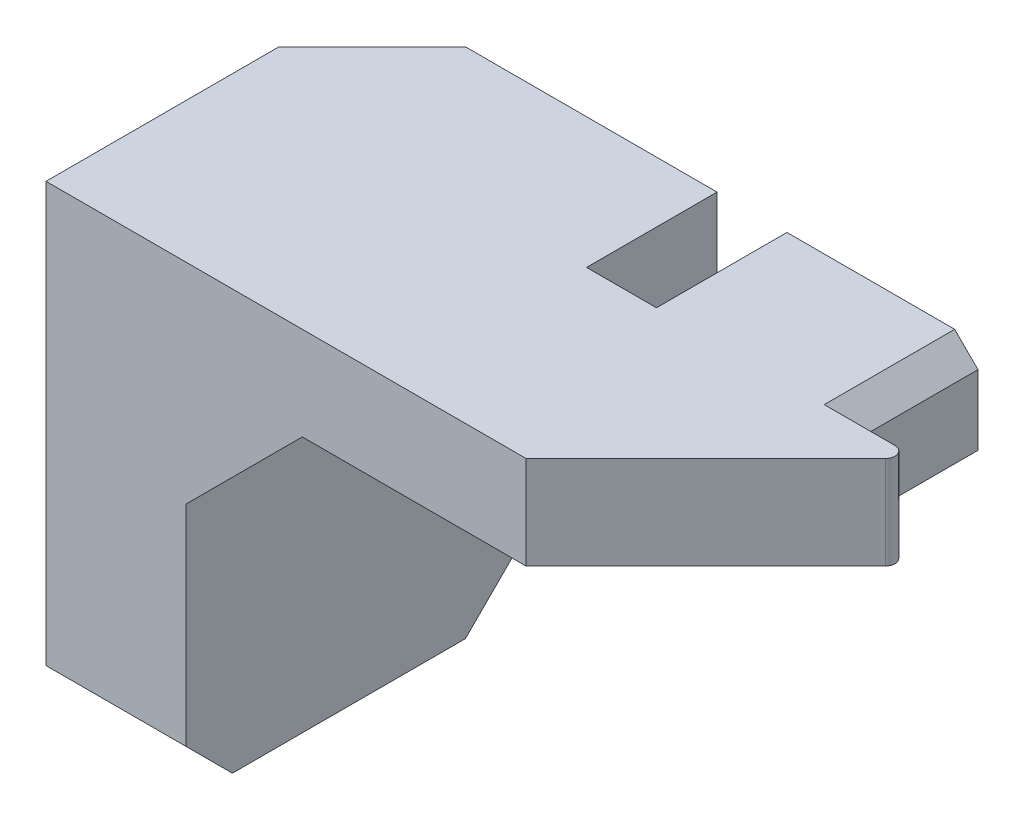
ISO-10303-21;
HEADER;
FILE_DESCRIPTION(('STEP AP214'),'2;1');
FILE_NAME('part.step','',(''),(''),'','','');
FILE_SCHEMA(('AUTOMOTIVE_DESIGN { 1 0 10303 214 1 1 1 1 }'));
ENDSEC;
DATA;
#1=APPLICATION_CONTEXT('core data for automotive mechanical design processes');
#2=APPLICATION_PROTOCOL_DEFINITION('international standard','automotive_design',2000,#1);
#3=PRODUCT_CONTEXT('',#1,'mechanical');
#4=PRODUCT('Part','Part','',(#3));
#5=PRODUCT_RELATED_PRODUCT_CATEGORY('part','',(#4));
#6=PRODUCT_DEFINITION_FORMATION('','',#4);
#7=PRODUCT_DEFINITION_CONTEXT('part definition',#1,'design');
#8=PRODUCT_DEFINITION('design','',#6,#7);
#9=PRODUCT_DEFINITION_SHAPE('','',#8);
#10=(LENGTH_UNIT() NAMED_UNIT(*) SI_UNIT(.MILLI.,.METRE.));
#11=(NAMED_UNIT(*) PLANE_ANGLE_UNIT() SI_UNIT($,.RADIAN.));
#12=(NAMED_UNIT(*) SI_UNIT($,.STERADIAN.) SOLID_ANGLE_UNIT());
#13=UNCERTAINTY_MEASURE_WITH_UNIT(LENGTH_MEASURE(1.E-05),#10,'distance_accuracy_value','');
#14=(GEOMETRIC_REPRESENTATION_CONTEXT(3) GLOBAL_UNCERTAINTY_ASSIGNED_CONTEXT((#13)) GLOBAL_UNIT_ASSIGNED_CONTEXT((#10,
#11,#12)) REPRESENTATION_CONTEXT('',''));
#15=CARTESIAN_POINT('',(0.,0.,0.));
#16=DIRECTION('',(0.,0.,1.));
#17=DIRECTION('',(1.,0.,0.));
#18=AXIS2_PLACEMENT_3D('',#15,#16,#17);
#19=CARTESIAN_POINT('',(0.,0.,0.));
#20=DIRECTION('',(0.,0.,-1.));
#21=DIRECTION('',(-1.,0.,0.));
#22=AXIS2_PLACEMENT_3D('',#19,#20,#21);
#23=PLANE('',#22);
#24=DIRECTION('',(-1.,0.,0.));
#25=VECTOR('',#24,1.);
#26=CARTESIAN_POINT('',(0.,25.4,0.));
#27=LINE('',#26,#25);
#28=CARTESIAN_POINT('',(31.75,25.4,0.));
#29=VERTEX_POINT('',#28);
#30=CARTESIAN_POINT('',(22.606,25.4,0.));
#31=VERTEX_POINT('',#30);
#32=EDGE_CURVE('E203',#29,#31,#27,.T.);
#33=ORIENTED_EDGE('',*,*,#32,.F.);
#34=DIRECTION('',(-0.707106781186544,0.707106781186551,0.));
#35=VECTOR('',#34,1.);
#36=CARTESIAN_POINT('',(28.5750000000002,28.5749999999999,0.));
#37=LINE('',#36,#35);
#38=CARTESIAN_POINT('',(33.02,24.13,0.));
#39=VERTEX_POINT('',#38);
#40=EDGE_CURVE('E261',#29,#39,#37,.F.);
#41=ORIENTED_EDGE('',*,*,#40,.T.);
#42=DIRECTION('',(0.,-1.,0.));
#43=VECTOR('',#42,1.);
#44=CARTESIAN_POINT('',(33.02,25.4,0.));
#45=LINE('',#44,#43);
#46=CARTESIAN_POINT('',(33.02,20.32,0.));
#47=VERTEX_POINT('',#46);
#48=EDGE_CURVE('E321',#39,#47,#45,.T.);
#49=ORIENTED_EDGE('',*,*,#48,.T.);
#50=DIRECTION('',(1.,0.,0.));
#51=VECTOR('',#50,1.);
#52=CARTESIAN_POINT('',(43.18,20.32,0.));
#53=LINE('',#52,#51);
#54=CARTESIAN_POINT('',(21.336,20.32,0.));
#55=VERTEX_POINT('',#54);
#56=EDGE_CURVE('E345',#55,#47,#53,.T.);
#57=ORIENTED_EDGE('',*,*,#56,.F.);
#58=DIRECTION('',(0.,-1.,0.));
#59=VECTOR('',#58,1.);
#60=CARTESIAN_POINT('',(21.336,25.4,0.));
#61=LINE('',#60,#59);
#62=CARTESIAN_POINT('',(21.336,24.13,0.));
#63=VERTEX_POINT('',#62);
#64=EDGE_CURVE('E285',#63,#55,#61,.T.);
#65=ORIENTED_EDGE('',*,*,#64,.F.);
#66=DIRECTION('',(-0.707106781186546,-0.707106781186549,0.));
#67=VECTOR('',#66,1.);
#68=CARTESIAN_POINT('',(-1.39699999999993,1.39699999999992,0.));
#69=LINE('',#68,#67);
#70=EDGE_CURVE('E259',#63,#31,#69,.F.);
#71=ORIENTED_EDGE('',*,*,#70,.T.);
#72=EDGE_LOOP('',(#33,#41,#49,#57,#65,#71));
#73=FACE_BOUND('',#72,.T.);
#74=ADVANCED_FACE('F41',(#73),#23,.T.);
#75=CARTESIAN_POINT('',(7.62,0.,17.78));
#76=DIRECTION('',(0.,1.,0.));
#77=DIRECTION('',(-1.,0.,0.));
#78=AXIS2_PLACEMENT_3D('',#75,#76,#77);
#79=PLANE('',#78);
#80=DIRECTION('',(0.,0.,-1.));
#81=VECTOR('',#80,1.);
#82=CARTESIAN_POINT('',(0.,0.,17.78));
#83=LINE('',#82,#81);
#84=CARTESIAN_POINT('',(0.,0.,15.24));
#85=VERTEX_POINT('',#84);
#86=CARTESIAN_POINT('',(0.,0.,2.54));
#87=VERTEX_POINT('',#86);
#88=EDGE_CURVE('E212',#85,#87,#83,.T.);
#89=ORIENTED_EDGE('',*,*,#88,.T.);
#90=DIRECTION('',(1.,0.,0.));
#91=VECTOR('',#90,1.);
#92=CARTESIAN_POINT('',(7.62,0.,2.54));
#93=LINE('',#92,#91);
#94=CARTESIAN_POINT('',(7.62,0.,2.54));
#95=VERTEX_POINT('',#94);
#96=EDGE_CURVE('E229',#87,#95,#93,.T.);
#97=ORIENTED_EDGE('',*,*,#96,.T.);
#98=DIRECTION('',(0.,0.,-1.));
#99=VECTOR('',#98,1.);
#100=CARTESIAN_POINT('',(7.62,0.,17.78));
#101=LINE('',#100,#99);
#102=CARTESIAN_POINT('',(7.62,0.,15.24));
#103=VERTEX_POINT('',#102);
#104=EDGE_CURVE('E224',#103,#95,#101,.T.);
#105=ORIENTED_EDGE('',*,*,#104,.F.);
#106=DIRECTION('',(-1.,0.,0.));
#107=VECTOR('',#106,1.);
#108=CARTESIAN_POINT('',(7.62,0.,15.24));
#109=LINE('',#108,#107);
#110=EDGE_CURVE('E227',#103,#85,#109,.T.);
#111=ORIENTED_EDGE('',*,*,#110,.T.);
#112=EDGE_LOOP('',(#89,#97,#105,#111));
#113=FACE_BOUND('',#112,.T.);
#114=ADVANCED_FACE('F392',(#113),#79,.F.);
#115=CARTESIAN_POINT('',(7.62,13.97,17.78));
#116=DIRECTION('',(-1.,0.,0.));
#117=DIRECTION('',(0.,-1.,0.));
#118=AXIS2_PLACEMENT_3D('',#115,#116,#117);
#119=PLANE('',#118);
#120=ORIENTED_EDGE('',*,*,#104,.T.);
#121=DIRECTION('',(0.,0.707106781186548,-0.707106781186547));
#122=VECTOR('',#121,1.);
#123=CARTESIAN_POINT('',(7.62,0.,2.54));
#124=LINE('',#123,#122);
#125=CARTESIAN_POINT('',(7.62,2.54000000000001,0.));
#126=VERTEX_POINT('',#125);
#127=EDGE_CURVE('E234',#95,#126,#124,.T.);
#128=ORIENTED_EDGE('',*,*,#127,.T.);
#129=DIRECTION('',(0.,1.,0.));
#130=VECTOR('',#129,1.);
#131=CARTESIAN_POINT('',(7.62,13.97,0.));
#132=LINE('',#131,#130);
#133=CARTESIAN_POINT('',(7.62,13.97,0.));
#134=VERTEX_POINT('',#133);
#135=EDGE_CURVE('E311',#126,#134,#132,.T.);
#136=ORIENTED_EDGE('',*,*,#135,.T.);
#137=DIRECTION('',(0.,0.,-1.));
#138=VECTOR('',#137,1.);
#139=CARTESIAN_POINT('',(7.62,13.97,17.78));
#140=LINE('',#139,#138);
#141=CARTESIAN_POINT('',(7.62,13.97,17.78));
#142=VERTEX_POINT('',#141);
#143=EDGE_CURVE('E221',#142,#134,#140,.T.);
#144=ORIENTED_EDGE('',*,*,#143,.F.);
#145=DIRECTION('',(0.,1.,0.));
#146=VECTOR('',#145,1.);
#147=CARTESIAN_POINT('',(7.62,13.97,17.78));
#148=LINE('',#147,#146);
#149=CARTESIAN_POINT('',(7.62,2.54,17.78));
#150=VERTEX_POINT('',#149);
#151=EDGE_CURVE('E202',#150,#142,#148,.T.);
#152=ORIENTED_EDGE('',*,*,#151,.F.);
#153=DIRECTION('',(0.,0.707106781186547,0.707106781186548));
#154=VECTOR('',#153,1.);
#155=CARTESIAN_POINT('',(7.62,2.54,17.78));
#156=LINE('',#155,#154);
#157=EDGE_CURVE('E232',#150,#103,#156,.F.);
#158=ORIENTED_EDGE('',*,*,#157,.T.);
#159=EDGE_LOOP('',(#120,#128,#136,#144,#152,#158));
#160=FACE_BOUND('',#159,.T.);
#161=ADVANCED_FACE('F399',(#160),#119,.F.);
#162=CARTESIAN_POINT('',(13.97,20.32,17.78));
#163=DIRECTION('',(-0.707106781186546,0.707106781186549,0.));
#164=DIRECTION('',(-0.707106781186549,-0.707106781186546,0.));
#165=AXIS2_PLACEMENT_3D('',#162,#163,#164);
#166=PLANE('',#165);
#167=DIRECTION('',(0.707106781186549,0.707106781186546,0.));
#168=VECTOR('',#167,1.);
#169=CARTESIAN_POINT('',(13.97,20.32,0.));
#170=LINE('',#169,#168);
#171=CARTESIAN_POINT('',(13.97,20.32,0.));
#172=VERTEX_POINT('',#171);
#173=EDGE_CURVE('E344',#134,#172,#170,.T.);
#174=ORIENTED_EDGE('',*,*,#173,.T.);
#175=DIRECTION('',(0.,0.,-1.));
#176=VECTOR('',#175,1.);
#177=CARTESIAN_POINT('',(13.97,20.32,17.78));
#178=LINE('',#177,#176);
#179=CARTESIAN_POINT('',(13.97,20.32,17.78));
#180=VERTEX_POINT('',#179);
#181=EDGE_CURVE('E218',#180,#172,#178,.T.);
#182=ORIENTED_EDGE('',*,*,#181,.F.);
#183=DIRECTION('',(0.707106781186549,0.707106781186546,0.));
#184=VECTOR('',#183,1.);
#185=CARTESIAN_POINT('',(13.97,20.32,17.78));
#186=LINE('',#185,#184);
#187=EDGE_CURVE('E205',#142,#180,#186,.T.);
#188=ORIENTED_EDGE('',*,*,#187,.F.);
#189=ORIENTED_EDGE('',*,*,#143,.T.);
#190=EDGE_LOOP('',(#174,#182,#188,#189));
#191=FACE_BOUND('',#190,.T.);
#192=ADVANCED_FACE('F543',(#191),#166,.F.);
#193=CARTESIAN_POINT('',(43.18,20.32,17.78));
#194=DIRECTION('',(0.,1.,0.));
#195=DIRECTION('',(-1.,0.,0.));
#196=AXIS2_PLACEMENT_3D('',#193,#194,#195);
#197=PLANE('',#196);
#198=DIRECTION('',(-1.,0.,0.));
#199=VECTOR('',#198,1.);
#200=CARTESIAN_POINT('',(33.02,20.32,7.112));
#201=LINE('',#200,#199);
#202=CARTESIAN_POINT('',(35.6035795103145,20.32,7.112));
#203=VERTEX_POINT('',#202);
#204=CARTESIAN_POINT('',(33.02,20.32,7.112));
#205=VERTEX_POINT('',#204);
#206=EDGE_CURVE('E327',#203,#205,#201,.T.);
#207=ORIENTED_EDGE('',*,*,#206,.F.);
#208=CARTESIAN_POINT('',(35.6035795103145,20.32,7.62));
#209=DIRECTION('',(0.,1.,0.));
#210=DIRECTION('',(-1.,0.,0.));
#211=AXIS2_PLACEMENT_3D('',#208,#209,#210);
#212=CIRCLE('',#211,0.508);
#213=CARTESIAN_POINT('',(35.9627897551572,20.32,7.97921024484277));
#214=VERTEX_POINT('',#213);
#215=EDGE_CURVE('E247',#203,#214,#212,.F.);
#216=ORIENTED_EDGE('',*,*,#215,.T.);
#217=DIRECTION('',(0.707106781186551,0.,-0.707106781186544));
#218=VECTOR('',#217,1.);
#219=CARTESIAN_POINT('',(36.83,20.32,7.112));
#220=LINE('',#219,#218);
#221=CARTESIAN_POINT('',(26.1619999999999,20.32,17.78));
#222=VERTEX_POINT('',#221);
#223=EDGE_CURVE('E307',#222,#214,#220,.T.);
#224=ORIENTED_EDGE('',*,*,#223,.F.);
#225=DIRECTION('',(1.,0.,0.));
#226=VECTOR('',#225,1.);
#227=CARTESIAN_POINT('',(43.18,20.32,17.78));
#228=LINE('',#227,#226);
#229=EDGE_CURVE('E336',#180,#222,#228,.T.);
#230=ORIENTED_EDGE('',*,*,#229,.F.);
#231=ORIENTED_EDGE('',*,*,#181,.T.);
#232=CARTESIAN_POINT('',(18.796,20.32,0.));
#233=VERTEX_POINT('',#232);
#234=EDGE_CURVE('E346',#172,#233,#53,.T.);
#235=ORIENTED_EDGE('',*,*,#234,.T.);
#236=DIRECTION('',(0.,0.,-1.));
#237=VECTOR('',#236,1.);
#238=CARTESIAN_POINT('',(18.796,20.32,0.));
#239=LINE('',#238,#237);
#240=CARTESIAN_POINT('',(18.796,20.32,7.112));
#241=VERTEX_POINT('',#240);
#242=EDGE_CURVE('E295',#241,#233,#239,.T.);
#243=ORIENTED_EDGE('',*,*,#242,.F.);
#244=DIRECTION('',(-1.,0.,0.));
#245=VECTOR('',#244,1.);
#246=CARTESIAN_POINT('',(21.336,20.32,7.112));
#247=LINE('',#246,#245);
#248=CARTESIAN_POINT('',(21.336,20.32,7.112));
#249=VERTEX_POINT('',#248);
#250=EDGE_CURVE('E299',#249,#241,#247,.T.);
#251=ORIENTED_EDGE('',*,*,#250,.F.);
#252=DIRECTION('',(0.,0.,1.));
#253=VECTOR('',#252,1.);
#254=CARTESIAN_POINT('',(21.336,20.32,0.));
#255=LINE('',#254,#253);
#256=EDGE_CURVE('E304',#55,#249,#255,.T.);
#257=ORIENTED_EDGE('',*,*,#256,.F.);
#258=ORIENTED_EDGE('',*,*,#56,.T.);
#259=DIRECTION('',(0.,0.,-1.));
#260=VECTOR('',#259,1.);
#261=CARTESIAN_POINT('',(33.02,20.32,0.));
#262=LINE('',#261,#260);
#263=EDGE_CURVE('E324',#205,#47,#262,.T.);
#264=ORIENTED_EDGE('',*,*,#263,.F.);
#265=EDGE_LOOP('',(#207,#216,#224,#230,#231,#235,#243,#251,#257,#258,#264));
#266=FACE_BOUND('',#265,.T.);
#267=ADVANCED_FACE('F355',(#266),#197,.F.);
#268=CARTESIAN_POINT('',(0.,25.4,17.78));
#269=DIRECTION('',(0.,-1.,0.));
#270=DIRECTION('',(0.,0.,-1.));
#271=AXIS2_PLACEMENT_3D('',#268,#269,#270);
#272=PLANE('',#271);
#273=DIRECTION('',(-1.,0.,0.));
#274=VECTOR('',#273,1.);
#275=CARTESIAN_POINT('',(33.02,25.4,7.112));
#276=LINE('',#275,#274);
#277=CARTESIAN_POINT('',(35.6035795103145,25.4,7.112));
#278=VERTEX_POINT('',#277);
#279=CARTESIAN_POINT('',(31.75,25.4,7.112));
#280=VERTEX_POINT('',#279);
#281=EDGE_CURVE('E271',#278,#280,#276,.T.);
#282=ORIENTED_EDGE('',*,*,#281,.T.);
#283=DIRECTION('',(0.,0.,-1.));
#284=VECTOR('',#283,1.);
#285=CARTESIAN_POINT('',(31.75,25.4,17.78));
#286=LINE('',#285,#284);
#287=EDGE_CURVE('E256',#280,#29,#286,.T.);
#288=ORIENTED_EDGE('',*,*,#287,.T.);
#289=ORIENTED_EDGE('',*,*,#32,.T.);
#290=DIRECTION('',(0.,0.,1.));
#291=VECTOR('',#290,1.);
#292=CARTESIAN_POINT('',(22.606,25.4,17.78));
#293=LINE('',#292,#291);
#294=CARTESIAN_POINT('',(22.606,25.4,7.112));
#295=VERTEX_POINT('',#294);
#296=EDGE_CURVE('E253',#31,#295,#293,.T.);
#297=ORIENTED_EDGE('',*,*,#296,.T.);
#298=DIRECTION('',(-1.,0.,0.));
#299=VECTOR('',#298,1.);
#300=CARTESIAN_POINT('',(21.336,25.4,7.112));
#301=LINE('',#300,#299);
#302=CARTESIAN_POINT('',(18.796,25.4,7.112));
#303=VERTEX_POINT('',#302);
#304=EDGE_CURVE('E290',#295,#303,#301,.T.);
#305=ORIENTED_EDGE('',*,*,#304,.T.);
#306=DIRECTION('',(0.,0.,-1.));
#307=VECTOR('',#306,1.);
#308=CARTESIAN_POINT('',(18.796,25.4,0.));
#309=LINE('',#308,#307);
#310=CARTESIAN_POINT('',(18.796,25.4,0.));
#311=VERTEX_POINT('',#310);
#312=EDGE_CURVE('E293',#303,#311,#309,.T.);
#313=ORIENTED_EDGE('',*,*,#312,.T.);
#314=CARTESIAN_POINT('',(5.08,25.4,0.));
#315=VERTEX_POINT('',#314);
#316=EDGE_CURVE('E208',#311,#315,#27,.T.);
#317=ORIENTED_EDGE('',*,*,#316,.T.);
#318=DIRECTION('',(0.707106781186547,0.,-0.707106781186548));
#319=VECTOR('',#318,1.);
#320=CARTESIAN_POINT('',(0.,25.4,5.08));
#321=LINE('',#320,#319);
#322=CARTESIAN_POINT('',(0.,25.4,5.08));
#323=VERTEX_POINT('',#322);
#324=EDGE_CURVE('E187',#323,#315,#321,.T.);
#325=ORIENTED_EDGE('',*,*,#324,.F.);
#326=DIRECTION('',(0.,0.,-1.));
#327=VECTOR('',#326,1.);
#328=CARTESIAN_POINT('',(0.,25.4,17.78));
#329=LINE('',#328,#327);
#330=CARTESIAN_POINT('',(0.,25.4,17.78));
#331=VERTEX_POINT('',#330);
#332=EDGE_CURVE('E215',#331,#323,#329,.T.);
#333=ORIENTED_EDGE('',*,*,#332,.F.);
#334=DIRECTION('',(-1.,0.,0.));
#335=VECTOR('',#334,1.);
#336=CARTESIAN_POINT('',(0.,25.4,17.78));
#337=LINE('',#336,#335);
#338=CARTESIAN_POINT('',(26.1619999999999,25.4,17.78));
#339=VERTEX_POINT('',#338);
#340=EDGE_CURVE('E339',#339,#331,#337,.T.);
#341=ORIENTED_EDGE('',*,*,#340,.F.);
#342=DIRECTION('',(0.707106781186551,0.,-0.707106781186544));
#343=VECTOR('',#342,1.);
#344=CARTESIAN_POINT('',(36.83,25.4,7.112));
#345=LINE('',#344,#343);
#346=CARTESIAN_POINT('',(35.9627897551572,25.4,7.97921024484277));
#347=VERTEX_POINT('',#346);
#348=EDGE_CURVE('E328',#339,#347,#345,.T.);
#349=ORIENTED_EDGE('',*,*,#348,.T.);
#350=CARTESIAN_POINT('',(35.6035795103145,25.4,7.62));
#351=DIRECTION('',(0.,-1.,0.));
#352=DIRECTION('',(0.,0.,-1.));
#353=AXIS2_PLACEMENT_3D('',#350,#351,#352);
#354=CIRCLE('',#353,0.508);
#355=EDGE_CURVE('E251',#347,#278,#354,.F.);
#356=ORIENTED_EDGE('',*,*,#355,.T.);
#357=EDGE_LOOP('',(#282,#288,#289,#297,#305,#313,#317,#325,#333,#341,#349,#356));
#358=FACE_BOUND('',#357,.T.);
#359=ADVANCED_FACE('F279',(#358),#272,.F.);
#360=CARTESIAN_POINT('',(0.,0.,17.78));
#361=DIRECTION('',(1.,0.,0.));
#362=DIRECTION('',(0.,0.,-1.));
#363=AXIS2_PLACEMENT_3D('',#360,#361,#362);
#364=PLANE('',#363);
#365=DIRECTION('',(0.,-1.,0.));
#366=VECTOR('',#365,1.);
#367=CARTESIAN_POINT('',(0.,0.,0.));
#368=LINE('',#367,#366);
#369=CARTESIAN_POINT('',(0.,20.32,0.));
#370=VERTEX_POINT('',#369);
#371=CARTESIAN_POINT('',(0.,2.54000000000001,0.));
#372=VERTEX_POINT('',#371);
#373=EDGE_CURVE('E193',#370,#372,#368,.T.);
#374=ORIENTED_EDGE('',*,*,#373,.T.);
#375=DIRECTION('',(0.,-0.707106781186548,0.707106781186547));
#376=VECTOR('',#375,1.);
#377=CARTESIAN_POINT('',(0.,0.,2.54));
#378=LINE('',#377,#376);
#379=EDGE_CURVE('E239',#372,#87,#378,.T.);
#380=ORIENTED_EDGE('',*,*,#379,.T.);
#381=ORIENTED_EDGE('',*,*,#88,.F.);
#382=DIRECTION('',(0.,-0.707106781186547,-0.707106781186548));
#383=VECTOR('',#382,1.);
#384=CARTESIAN_POINT('',(0.,2.54,17.78));
#385=LINE('',#384,#383);
#386=CARTESIAN_POINT('',(0.,2.54,17.78));
#387=VERTEX_POINT('',#386);
#388=EDGE_CURVE('E237',#85,#387,#385,.F.);
#389=ORIENTED_EDGE('',*,*,#388,.T.);
#390=DIRECTION('',(0.,-1.,0.));
#391=VECTOR('',#390,1.);
#392=CARTESIAN_POINT('',(0.,0.,17.78));
#393=LINE('',#392,#391);
#394=EDGE_CURVE('E216',#331,#387,#393,.T.);
#395=ORIENTED_EDGE('',*,*,#394,.F.);
#396=ORIENTED_EDGE('',*,*,#332,.T.);
#397=DIRECTION('',(0.,1.,0.));
#398=VECTOR('',#397,1.);
#399=CARTESIAN_POINT('',(0.,20.32,5.08));
#400=LINE('',#399,#398);
#401=CARTESIAN_POINT('',(0.,20.32,5.08));
#402=VERTEX_POINT('',#401);
#403=EDGE_CURVE('E196',#402,#323,#400,.T.);
#404=ORIENTED_EDGE('',*,*,#403,.F.);
#405=DIRECTION('',(0.,0.,1.));
#406=VECTOR('',#405,1.);
#407=CARTESIAN_POINT('',(0.,20.32,0.));
#408=LINE('',#407,#406);
#409=EDGE_CURVE('E180',#370,#402,#408,.T.);
#410=ORIENTED_EDGE('',*,*,#409,.F.);
#411=EDGE_LOOP('',(#374,#380,#381,#389,#395,#396,#404,#410));
#412=FACE_BOUND('',#411,.T.);
#413=ADVANCED_FACE('F192',(#412),#364,.F.);
#414=CARTESIAN_POINT('',(0.,0.,17.78));
#415=DIRECTION('',(0.,0.,-1.));
#416=DIRECTION('',(-1.,0.,0.));
#417=AXIS2_PLACEMENT_3D('',#414,#415,#416);
#418=PLANE('',#417);
#419=ORIENTED_EDGE('',*,*,#394,.T.);
#420=DIRECTION('',(1.,0.,0.));
#421=VECTOR('',#420,1.);
#422=CARTESIAN_POINT('',(0.,2.54,17.78));
#423=LINE('',#422,#421);
#424=EDGE_CURVE('E241',#387,#150,#423,.T.);
#425=ORIENTED_EDGE('',*,*,#424,.T.);
#426=ORIENTED_EDGE('',*,*,#151,.T.);
#427=ORIENTED_EDGE('',*,*,#187,.T.);
#428=ORIENTED_EDGE('',*,*,#229,.T.);
#429=DIRECTION('',(0.,-1.,0.));
#430=VECTOR('',#429,1.);
#431=CARTESIAN_POINT('',(26.1619999999999,25.4,17.78));
#432=LINE('',#431,#430);
#433=EDGE_CURVE('E318',#339,#222,#432,.T.);
#434=ORIENTED_EDGE('',*,*,#433,.F.);
#435=ORIENTED_EDGE('',*,*,#340,.T.);
#436=EDGE_LOOP('',(#419,#425,#426,#427,#428,#434,#435));
#437=FACE_BOUND('',#436,.T.);
#438=ADVANCED_FACE('F370',(#437),#418,.F.);
#439=ORIENTED_EDGE('',*,*,#135,.F.);
#440=DIRECTION('',(-1.,0.,0.));
#441=VECTOR('',#440,1.);
#442=CARTESIAN_POINT('',(0.,2.54000000000001,0.));
#443=LINE('',#442,#441);
#444=EDGE_CURVE('E201',#126,#372,#443,.T.);
#445=ORIENTED_EDGE('',*,*,#444,.T.);
#446=ORIENTED_EDGE('',*,*,#373,.F.);
#447=DIRECTION('',(-1.,0.,0.));
#448=VECTOR('',#447,1.);
#449=CARTESIAN_POINT('',(5.08,20.32,0.));
#450=LINE('',#449,#448);
#451=CARTESIAN_POINT('',(5.08,20.32,0.));
#452=VERTEX_POINT('',#451);
#453=EDGE_CURVE('E177',#452,#370,#450,.T.);
#454=ORIENTED_EDGE('',*,*,#453,.F.);
#455=DIRECTION('',(0.,1.,0.));
#456=VECTOR('',#455,1.);
#457=CARTESIAN_POINT('',(5.08,20.32,0.));
#458=LINE('',#457,#456);
#459=EDGE_CURVE('E323',#452,#315,#458,.T.);
#460=ORIENTED_EDGE('',*,*,#459,.T.);
#461=ORIENTED_EDGE('',*,*,#316,.F.);
#462=DIRECTION('',(0.,-1.,0.));
#463=VECTOR('',#462,1.);
#464=CARTESIAN_POINT('',(18.796,25.4,0.));
#465=LINE('',#464,#463);
#466=EDGE_CURVE('E312',#311,#233,#465,.T.);
#467=ORIENTED_EDGE('',*,*,#466,.T.);
#468=ORIENTED_EDGE('',*,*,#234,.F.);
#469=ORIENTED_EDGE('',*,*,#173,.F.);
#470=EDGE_LOOP('',(#439,#445,#446,#454,#460,#461,#467,#468,#469));
#471=FACE_BOUND('',#470,.T.);
#472=ADVANCED_FACE('F199',(#471),#23,.T.);
#473=CARTESIAN_POINT('',(33.02,25.4,0.));
#474=DIRECTION('',(-1.,0.,0.));
#475=DIRECTION('',(0.,-1.,0.));
#476=AXIS2_PLACEMENT_3D('',#473,#474,#475);
#477=PLANE('',#476);
#478=ORIENTED_EDGE('',*,*,#48,.F.);
#479=DIRECTION('',(0.,0.,1.));
#480=VECTOR('',#479,1.);
#481=CARTESIAN_POINT('',(33.02,24.13,0.));
#482=LINE('',#481,#480);
#483=CARTESIAN_POINT('',(33.02,24.13,7.112));
#484=VERTEX_POINT('',#483);
#485=EDGE_CURVE('E63',#39,#484,#482,.T.);
#486=ORIENTED_EDGE('',*,*,#485,.T.);
#487=DIRECTION('',(0.,-1.,0.));
#488=VECTOR('',#487,1.);
#489=CARTESIAN_POINT('',(33.02,25.4,7.112));
#490=LINE('',#489,#488);
#491=EDGE_CURVE('E274',#484,#205,#490,.T.);
#492=ORIENTED_EDGE('',*,*,#491,.T.);
#493=ORIENTED_EDGE('',*,*,#263,.T.);
#494=EDGE_LOOP('',(#478,#486,#492,#493));
#495=FACE_BOUND('',#494,.T.);
#496=ADVANCED_FACE('F357',(#495),#477,.F.);
#497=CARTESIAN_POINT('',(33.02,25.4,7.112));
#498=DIRECTION('',(0.,0.,1.));
#499=DIRECTION('',(1.,0.,0.));
#500=AXIS2_PLACEMENT_3D('',#497,#498,#499);
#501=PLANE('',#500);
#502=ORIENTED_EDGE('',*,*,#281,.F.);
#503=DIRECTION('',(0.,-1.,0.));
#504=VECTOR('',#503,1.);
#505=CARTESIAN_POINT('',(35.6035795103145,25.4,7.112));
#506=LINE('',#505,#504);
#507=EDGE_CURVE('E244',#278,#203,#506,.T.);
#508=ORIENTED_EDGE('',*,*,#507,.T.);
#509=ORIENTED_EDGE('',*,*,#206,.T.);
#510=ORIENTED_EDGE('',*,*,#491,.F.);
#511=DIRECTION('',(0.707106781186544,-0.707106781186551,0.));
#512=VECTOR('',#511,1.);
#513=CARTESIAN_POINT('',(32.385,24.765,7.112));
#514=LINE('',#513,#512);
#515=EDGE_CURVE('E50',#484,#280,#514,.F.);
#516=ORIENTED_EDGE('',*,*,#515,.T.);
#517=EDGE_LOOP('',(#502,#508,#509,#510,#516));
#518=FACE_BOUND('',#517,.T.);
#519=ADVANCED_FACE('F270',(#518),#501,.F.);
#520=CARTESIAN_POINT('',(36.83,25.4,7.112));
#521=DIRECTION('',(-0.707106781186544,0.,-0.707106781186551));
#522=DIRECTION('',(-0.707106781186551,0.,0.707106781186544));
#523=AXIS2_PLACEMENT_3D('',#520,#521,#522);
#524=PLANE('',#523);
#525=ORIENTED_EDGE('',*,*,#223,.T.);
#526=DIRECTION('',(0.,-1.,0.));
#527=VECTOR('',#526,1.);
#528=CARTESIAN_POINT('',(35.9627897551572,25.4,7.97921024484277));
#529=LINE('',#528,#527);
#530=EDGE_CURVE('E249',#214,#347,#529,.F.);
#531=ORIENTED_EDGE('',*,*,#530,.T.);
#532=ORIENTED_EDGE('',*,*,#348,.F.);
#533=ORIENTED_EDGE('',*,*,#433,.T.);
#534=EDGE_LOOP('',(#525,#531,#532,#533));
#535=FACE_BOUND('',#534,.T.);
#536=ADVANCED_FACE('F363',(#535),#524,.F.);
#537=CARTESIAN_POINT('',(21.336,25.4,0.));
#538=DIRECTION('',(1.,0.,0.));
#539=DIRECTION('',(0.,1.,0.));
#540=AXIS2_PLACEMENT_3D('',#537,#538,#539);
#541=PLANE('',#540);
#542=DIRECTION('',(0.,-1.,0.));
#543=VECTOR('',#542,1.);
#544=CARTESIAN_POINT('',(21.336,25.4,7.112));
#545=LINE('',#544,#543);
#546=CARTESIAN_POINT('',(21.336,24.13,7.112));
#547=VERTEX_POINT('',#546);
#548=EDGE_CURVE('E297',#547,#249,#545,.T.);
#549=ORIENTED_EDGE('',*,*,#548,.F.);
#550=DIRECTION('',(0.,0.,-1.));
#551=VECTOR('',#550,1.);
#552=CARTESIAN_POINT('',(21.336,24.13,0.));
#553=LINE('',#552,#551);
#554=EDGE_CURVE('E264',#547,#63,#553,.T.);
#555=ORIENTED_EDGE('',*,*,#554,.T.);
#556=ORIENTED_EDGE('',*,*,#64,.T.);
#557=ORIENTED_EDGE('',*,*,#256,.T.);
#558=EDGE_LOOP('',(#549,#555,#556,#557));
#559=FACE_BOUND('',#558,.T.);
#560=ADVANCED_FACE('F379',(#559),#541,.F.);
#561=CARTESIAN_POINT('',(18.796,25.4,0.));
#562=DIRECTION('',(-1.,0.,0.));
#563=DIRECTION('',(0.,-1.,0.));
#564=AXIS2_PLACEMENT_3D('',#561,#562,#563);
#565=PLANE('',#564);
#566=ORIENTED_EDGE('',*,*,#242,.T.);
#567=ORIENTED_EDGE('',*,*,#466,.F.);
#568=ORIENTED_EDGE('',*,*,#312,.F.);
#569=DIRECTION('',(0.,-1.,0.));
#570=VECTOR('',#569,1.);
#571=CARTESIAN_POINT('',(18.796,25.4,7.112));
#572=LINE('',#571,#570);
#573=EDGE_CURVE('E315',#303,#241,#572,.T.);
#574=ORIENTED_EDGE('',*,*,#573,.T.);
#575=EDGE_LOOP('',(#566,#567,#568,#574));
#576=FACE_BOUND('',#575,.T.);
#577=ADVANCED_FACE('F376',(#576),#565,.F.);
#578=CARTESIAN_POINT('',(21.336,25.4,7.112));
#579=DIRECTION('',(0.,0.,1.));
#580=DIRECTION('',(1.,0.,0.));
#581=AXIS2_PLACEMENT_3D('',#578,#579,#580);
#582=PLANE('',#581);
#583=ORIENTED_EDGE('',*,*,#250,.T.);
#584=ORIENTED_EDGE('',*,*,#573,.F.);
#585=ORIENTED_EDGE('',*,*,#304,.F.);
#586=DIRECTION('',(0.707106781186546,0.707106781186549,0.));
#587=VECTOR('',#586,1.);
#588=CARTESIAN_POINT('',(21.971,24.765,7.112));
#589=LINE('',#588,#587);
#590=EDGE_CURVE('E11',#295,#547,#589,.F.);
#591=ORIENTED_EDGE('',*,*,#590,.T.);
#592=ORIENTED_EDGE('',*,*,#548,.T.);
#593=EDGE_LOOP('',(#583,#584,#585,#591,#592));
#594=FACE_BOUND('',#593,.T.);
#595=ADVANCED_FACE('F377',(#594),#582,.F.);
#596=CARTESIAN_POINT('',(0.,20.32,5.08));
#597=DIRECTION('',(0.707106781186548,0.,0.707106781186547));
#598=DIRECTION('',(0.707106781186547,0.,-0.707106781186548));
#599=AXIS2_PLACEMENT_3D('',#596,#597,#598);
#600=PLANE('',#599);
#601=ORIENTED_EDGE('',*,*,#324,.T.);
#602=ORIENTED_EDGE('',*,*,#459,.F.);
#603=DIRECTION('',(0.707106781186547,0.,-0.707106781186548));
#604=VECTOR('',#603,1.);
#605=CARTESIAN_POINT('',(0.,20.32,5.08));
#606=LINE('',#605,#604);
#607=EDGE_CURVE('E182',#402,#452,#606,.T.);
#608=ORIENTED_EDGE('',*,*,#607,.F.);
#609=ORIENTED_EDGE('',*,*,#403,.T.);
#610=EDGE_LOOP('',(#601,#602,#608,#609));
#611=FACE_BOUND('',#610,.T.);
#612=ADVANCED_FACE('F477',(#611),#600,.F.);
#613=CARTESIAN_POINT('',(0.,20.32,0.));
#614=DIRECTION('',(0.,1.,0.));
#615=DIRECTION('',(0.,0.,1.));
#616=AXIS2_PLACEMENT_3D('',#613,#614,#615);
#617=PLANE('',#616);
#618=ORIENTED_EDGE('',*,*,#453,.T.);
#619=ORIENTED_EDGE('',*,*,#409,.T.);
#620=ORIENTED_EDGE('',*,*,#607,.T.);
#621=EDGE_LOOP('',(#618,#619,#620));
#622=FACE_BOUND('',#621,.T.);
#623=ADVANCED_FACE('F179',(#622),#617,.T.);
#624=CARTESIAN_POINT('',(7.62,0.,2.54));
#625=DIRECTION('',(0.,-0.707106781186547,-0.707106781186548));
#626=DIRECTION('',(-1.,0.,0.));
#627=AXIS2_PLACEMENT_3D('',#624,#625,#626);
#628=PLANE('',#627);
#629=ORIENTED_EDGE('',*,*,#379,.F.);
#630=ORIENTED_EDGE('',*,*,#444,.F.);
#631=ORIENTED_EDGE('',*,*,#127,.F.);
#632=ORIENTED_EDGE('',*,*,#96,.F.);
#633=EDGE_LOOP('',(#629,#630,#631,#632));
#634=FACE_BOUND('',#633,.T.);
#635=ADVANCED_FACE('F492',(#634),#628,.T.);
#636=CARTESIAN_POINT('',(0.,2.54,17.78));
#637=DIRECTION('',(0.,0.707106781186548,-0.707106781186547));
#638=DIRECTION('',(1.,0.,0.));
#639=AXIS2_PLACEMENT_3D('',#636,#637,#638);
#640=PLANE('',#639);
#641=ORIENTED_EDGE('',*,*,#388,.F.);
#642=ORIENTED_EDGE('',*,*,#110,.F.);
#643=ORIENTED_EDGE('',*,*,#157,.F.);
#644=ORIENTED_EDGE('',*,*,#424,.F.);
#645=EDGE_LOOP('',(#641,#642,#643,#644));
#646=FACE_BOUND('',#645,.T.);
#647=ADVANCED_FACE('F499',(#646),#640,.F.);
#648=CARTESIAN_POINT('',(35.6035795103145,25.4,7.62));
#649=DIRECTION('',(0.,-1.,0.));
#650=DIRECTION('',(1.,0.,0.));
#651=AXIS2_PLACEMENT_3D('',#648,#649,#650);
#652=CYLINDRICAL_SURFACE('',#651,0.508);
#653=ORIENTED_EDGE('',*,*,#355,.F.);
#654=ORIENTED_EDGE('',*,*,#530,.F.);
#655=ORIENTED_EDGE('',*,*,#215,.F.);
#656=ORIENTED_EDGE('',*,*,#507,.F.);
#657=EDGE_LOOP('',(#653,#654,#655,#656));
#658=FACE_BOUND('',#657,.T.);
#659=ADVANCED_FACE('F366',(#658),#652,.T.);
#660=CARTESIAN_POINT('',(31.75,25.4,17.78));
#661=DIRECTION('',(-0.707106781186551,-0.707106781186544,0.));
#662=DIRECTION('',(0.,0.,-1.));
#663=AXIS2_PLACEMENT_3D('',#660,#661,#662);
#664=PLANE('',#663);
#665=ORIENTED_EDGE('',*,*,#515,.F.);
#666=ORIENTED_EDGE('',*,*,#485,.F.);
#667=ORIENTED_EDGE('',*,*,#40,.F.);
#668=ORIENTED_EDGE('',*,*,#287,.F.);
#669=EDGE_LOOP('',(#665,#666,#667,#668));
#670=FACE_BOUND('',#669,.T.);
#671=ADVANCED_FACE('F276',(#670),#664,.F.);
#672=CARTESIAN_POINT('',(22.606,25.4,17.78));
#673=DIRECTION('',(0.707106781186549,-0.707106781186546,0.));
#674=DIRECTION('',(0.,0.,1.));
#675=AXIS2_PLACEMENT_3D('',#672,#673,#674);
#676=PLANE('',#675);
#677=ORIENTED_EDGE('',*,*,#70,.F.);
#678=ORIENTED_EDGE('',*,*,#554,.F.);
#679=ORIENTED_EDGE('',*,*,#590,.F.);
#680=ORIENTED_EDGE('',*,*,#296,.F.);
#681=EDGE_LOOP('',(#677,#678,#679,#680));
#682=FACE_BOUND('',#681,.T.);
#683=ADVANCED_FACE('F44',(#682),#676,.F.);
#684=CLOSED_SHELL('',(#74,#114,#161,#192,#267,#359,#413,#438,#472,#496,#519,#536,#560,#577,#595,
#612,#623,#635,#647,#659,#671,#683));
#685=MANIFOLD_SOLID_BREP('B2',#684);
#686=ADVANCED_BREP_SHAPE_REPRESENTATION('',(#18,#685),#14);
#687=SHAPE_DEFINITION_REPRESENTATION(#9,#686);
ENDSEC;
END-ISO-10303-21;
